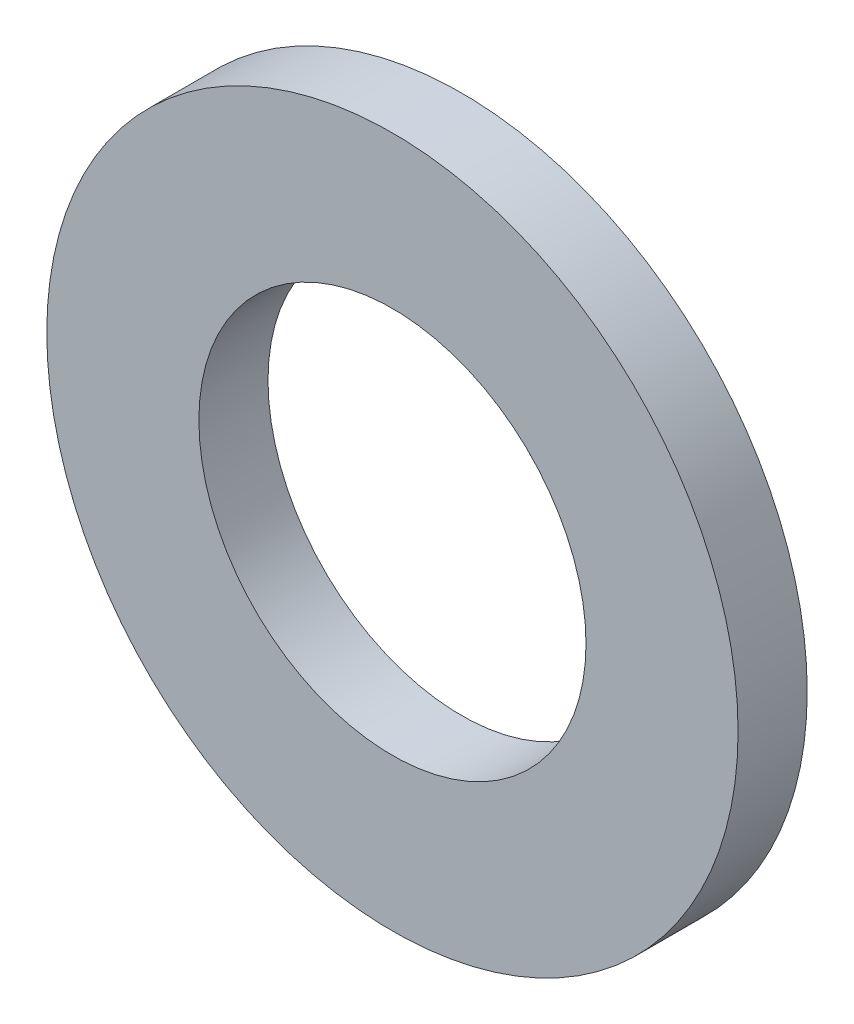
ISO-10303-21;
HEADER;
FILE_DESCRIPTION(('STEP AP214'),'2;1');
FILE_NAME('part.step','',(''),(''),'','','');
FILE_SCHEMA(('AUTOMOTIVE_DESIGN { 1 0 10303 214 1 1 1 1 }'));
ENDSEC;
DATA;
#1=APPLICATION_CONTEXT('core data for automotive mechanical design processes');
#2=APPLICATION_PROTOCOL_DEFINITION('international standard','automotive_design',2000,#1);
#3=PRODUCT_CONTEXT('',#1,'mechanical');
#4=PRODUCT('Part','Part','',(#3));
#5=PRODUCT_RELATED_PRODUCT_CATEGORY('part','',(#4));
#6=PRODUCT_DEFINITION_FORMATION('','',#4);
#7=PRODUCT_DEFINITION_CONTEXT('part definition',#1,'design');
#8=PRODUCT_DEFINITION('design','',#6,#7);
#9=PRODUCT_DEFINITION_SHAPE('','',#8);
#10=(LENGTH_UNIT() NAMED_UNIT(*) SI_UNIT(.MILLI.,.METRE.));
#11=(NAMED_UNIT(*) PLANE_ANGLE_UNIT() SI_UNIT($,.RADIAN.));
#12=(NAMED_UNIT(*) SI_UNIT($,.STERADIAN.) SOLID_ANGLE_UNIT());
#13=UNCERTAINTY_MEASURE_WITH_UNIT(LENGTH_MEASURE(1.E-05),#10,'distance_accuracy_value','');
#14=(GEOMETRIC_REPRESENTATION_CONTEXT(3) GLOBAL_UNCERTAINTY_ASSIGNED_CONTEXT((#13)) GLOBAL_UNIT_ASSIGNED_CONTEXT((#10,
#11,#12)) REPRESENTATION_CONTEXT('',''));
#15=CARTESIAN_POINT('',(0.,0.,0.));
#16=DIRECTION('',(0.,0.,1.));
#17=DIRECTION('',(1.,0.,0.));
#18=AXIS2_PLACEMENT_3D('',#15,#16,#17);
#19=CARTESIAN_POINT('',(0.,0.,1.));
#20=DIRECTION('',(0.,0.,1.));
#21=DIRECTION('',(1.,0.,0.));
#22=AXIS2_PLACEMENT_3D('',#19,#20,#21);
#23=PLANE('',#22);
#24=CARTESIAN_POINT('',(0.,0.,1.));
#25=DIRECTION('',(0.,0.,1.));
#26=DIRECTION('',(1.,0.,0.));
#27=AXIS2_PLACEMENT_3D('',#24,#25,#26);
#28=CIRCLE('',#27,5.);
#29=CARTESIAN_POINT('',(5.,0.,1.));
#30=VERTEX_POINT('',#29);
#31=EDGE_CURVE('E10',#30,#30,#28,.T.);
#32=ORIENTED_EDGE('',*,*,#31,.T.);
#33=EDGE_LOOP('',(#32));
#34=FACE_BOUND('',#33,.T.);
#35=CARTESIAN_POINT('',(0.,0.,1.));
#36=DIRECTION('',(0.,0.,1.));
#37=DIRECTION('',(1.,0.,0.));
#38=AXIS2_PLACEMENT_3D('',#35,#36,#37);
#39=CIRCLE('',#38,2.8);
#40=CARTESIAN_POINT('',(2.8,0.,1.));
#41=VERTEX_POINT('',#40);
#42=EDGE_CURVE('E41',#41,#41,#39,.T.);
#43=ORIENTED_EDGE('',*,*,#42,.F.);
#44=EDGE_LOOP('',(#43));
#45=FACE_BOUND('',#44,.T.);
#46=ADVANCED_FACE('F30',(#34,#45),#23,.T.);
#47=CARTESIAN_POINT('',(0.,0.,0.));
#48=DIRECTION('',(0.,0.,1.));
#49=DIRECTION('',(1.,0.,0.));
#50=AXIS2_PLACEMENT_3D('',#47,#48,#49);
#51=PLANE('',#50);
#52=CARTESIAN_POINT('',(0.,0.,0.));
#53=DIRECTION('',(0.,0.,1.));
#54=DIRECTION('',(1.,0.,0.));
#55=AXIS2_PLACEMENT_3D('',#52,#53,#54);
#56=CIRCLE('',#55,5.);
#57=CARTESIAN_POINT('',(5.,0.,0.));
#58=VERTEX_POINT('',#57);
#59=EDGE_CURVE('E34',#58,#58,#56,.T.);
#60=ORIENTED_EDGE('',*,*,#59,.F.);
#61=EDGE_LOOP('',(#60));
#62=FACE_BOUND('',#61,.T.);
#63=CARTESIAN_POINT('',(0.,0.,0.));
#64=DIRECTION('',(0.,0.,1.));
#65=DIRECTION('',(1.,0.,0.));
#66=AXIS2_PLACEMENT_3D('',#63,#64,#65);
#67=CIRCLE('',#66,2.8);
#68=CARTESIAN_POINT('',(2.8,0.,0.));
#69=VERTEX_POINT('',#68);
#70=EDGE_CURVE('E43',#69,#69,#67,.T.);
#71=ORIENTED_EDGE('',*,*,#70,.T.);
#72=EDGE_LOOP('',(#71));
#73=FACE_BOUND('',#72,.T.);
#74=ADVANCED_FACE('F53',(#62,#73),#51,.F.);
#75=CARTESIAN_POINT('',(0.,0.,1.));
#76=DIRECTION('',(0.,0.,-1.));
#77=DIRECTION('',(-1.,0.,0.));
#78=AXIS2_PLACEMENT_3D('',#75,#76,#77);
#79=CYLINDRICAL_SURFACE('',#78,5.);
#80=ORIENTED_EDGE('',*,*,#31,.F.);
#81=EDGE_LOOP('',(#80));
#82=FACE_BOUND('',#81,.T.);
#83=ORIENTED_EDGE('',*,*,#59,.T.);
#84=EDGE_LOOP('',(#83));
#85=FACE_BOUND('',#84,.T.);
#86=ADVANCED_FACE('F32',(#82,#85),#79,.T.);
#87=CARTESIAN_POINT('',(0.,0.,1.));
#88=DIRECTION('',(0.,0.,-1.));
#89=DIRECTION('',(-1.,0.,0.));
#90=AXIS2_PLACEMENT_3D('',#87,#88,#89);
#91=CYLINDRICAL_SURFACE('',#90,2.8);
#92=ORIENTED_EDGE('',*,*,#42,.T.);
#93=EDGE_LOOP('',(#92));
#94=FACE_BOUND('',#93,.T.);
#95=ORIENTED_EDGE('',*,*,#70,.F.);
#96=EDGE_LOOP('',(#95));
#97=FACE_BOUND('',#96,.T.);
#98=ADVANCED_FACE('F49',(#94,#97),#91,.F.);
#99=CLOSED_SHELL('',(#46,#74,#86,#98));
#100=MANIFOLD_SOLID_BREP('B2',#99);
#101=ADVANCED_BREP_SHAPE_REPRESENTATION('',(#18,#100),#14);
#102=SHAPE_DEFINITION_REPRESENTATION(#9,#101);
ENDSEC;
END-ISO-10303-21;
